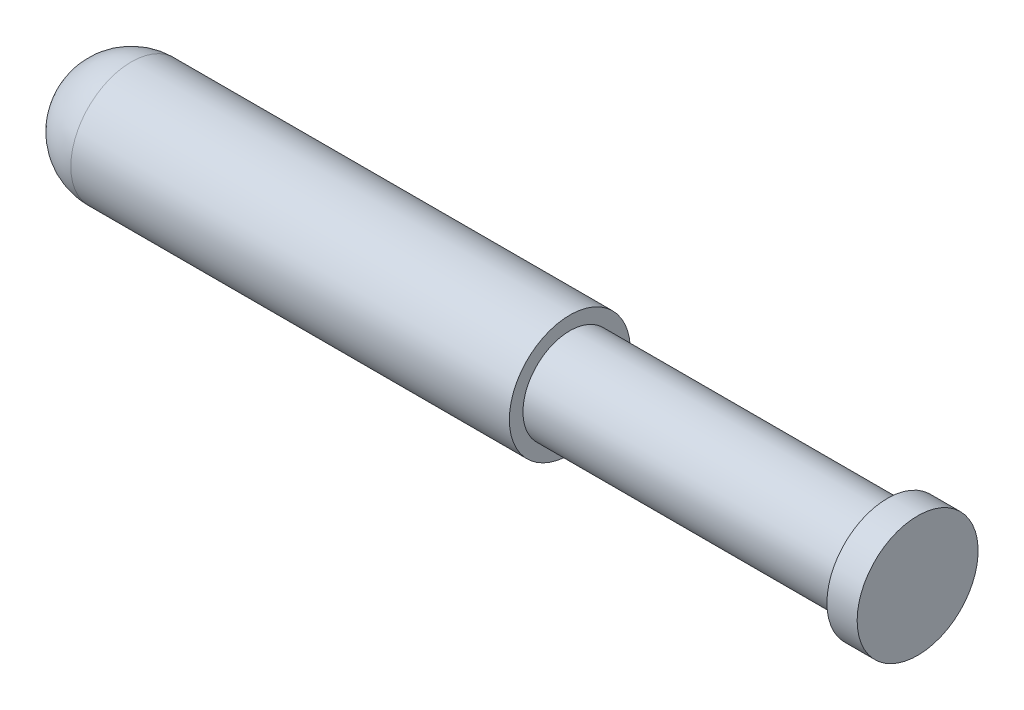
ISO-10303-21;
HEADER;
FILE_DESCRIPTION(('STEP AP214'),'2;1');
FILE_NAME('part.step','',(''),(''),'','','');
FILE_SCHEMA(('AUTOMOTIVE_DESIGN { 1 0 10303 214 1 1 1 1 }'));
ENDSEC;
DATA;
#1=APPLICATION_CONTEXT('core data for automotive mechanical design processes');
#2=APPLICATION_PROTOCOL_DEFINITION('international standard','automotive_design',2000,#1);
#3=PRODUCT_CONTEXT('',#1,'mechanical');
#4=PRODUCT('Part','Part','',(#3));
#5=PRODUCT_RELATED_PRODUCT_CATEGORY('part','',(#4));
#6=PRODUCT_DEFINITION_FORMATION('','',#4);
#7=PRODUCT_DEFINITION_CONTEXT('part definition',#1,'design');
#8=PRODUCT_DEFINITION('design','',#6,#7);
#9=PRODUCT_DEFINITION_SHAPE('','',#8);
#10=(LENGTH_UNIT() NAMED_UNIT(*) SI_UNIT(.MILLI.,.METRE.));
#11=(NAMED_UNIT(*) PLANE_ANGLE_UNIT() SI_UNIT($,.RADIAN.));
#12=(NAMED_UNIT(*) SI_UNIT($,.STERADIAN.) SOLID_ANGLE_UNIT());
#13=UNCERTAINTY_MEASURE_WITH_UNIT(LENGTH_MEASURE(1.E-05),#10,'distance_accuracy_value','');
#14=(GEOMETRIC_REPRESENTATION_CONTEXT(3) GLOBAL_UNCERTAINTY_ASSIGNED_CONTEXT((#13)) GLOBAL_UNIT_ASSIGNED_CONTEXT((#10,
#11,#12)) REPRESENTATION_CONTEXT('',''));
#15=CARTESIAN_POINT('',(0.,0.,0.));
#16=DIRECTION('',(0.,0.,1.));
#17=DIRECTION('',(1.,0.,0.));
#18=AXIS2_PLACEMENT_3D('',#15,#16,#17);
#19=CARTESIAN_POINT('',(0.,0.,0.));
#20=DIRECTION('',(-1.,0.,0.));
#21=DIRECTION('',(0.,0.,1.));
#22=AXIS2_PLACEMENT_3D('',#19,#20,#21);
#23=CYLINDRICAL_SURFACE('',#22,3.99999999999999);
#24=CARTESIAN_POINT('',(4.,0.,0.));
#25=DIRECTION('',(-1.,0.,0.));
#26=DIRECTION('',(0.,0.,1.));
#27=AXIS2_PLACEMENT_3D('',#24,#25,#26);
#28=CIRCLE('',#27,3.99999999999999);
#29=CARTESIAN_POINT('',(4.,0.,3.99999999999999));
#30=VERTEX_POINT('',#29);
#31=EDGE_CURVE('E10',#30,#30,#28,.F.);
#32=ORIENTED_EDGE('',*,*,#31,.T.);
#33=EDGE_LOOP('',(#32));
#34=FACE_BOUND('',#33,.T.);
#35=CARTESIAN_POINT('',(33.,0.,0.));
#36=DIRECTION('',(-1.,0.,0.));
#37=DIRECTION('',(0.,0.,1.));
#38=AXIS2_PLACEMENT_3D('',#35,#36,#37);
#39=CIRCLE('',#38,3.99999999999999);
#40=CARTESIAN_POINT('',(33.,0.,3.99999999999999));
#41=VERTEX_POINT('',#40);
#42=EDGE_CURVE('E38',#41,#41,#39,.T.);
#43=ORIENTED_EDGE('',*,*,#42,.T.);
#44=EDGE_LOOP('',(#43));
#45=FACE_BOUND('',#44,.T.);
#46=ADVANCED_FACE('F31',(#34,#45),#23,.T.);
#47=CARTESIAN_POINT('',(33.,3.99999999999999,0.));
#48=DIRECTION('',(-1.,0.,0.));
#49=DIRECTION('',(0.,0.,1.));
#50=AXIS2_PLACEMENT_3D('',#47,#48,#49);
#51=PLANE('',#50);
#52=ORIENTED_EDGE('',*,*,#42,.F.);
#53=EDGE_LOOP('',(#52));
#54=FACE_BOUND('',#53,.T.);
#55=CARTESIAN_POINT('',(33.,0.,0.));
#56=DIRECTION('',(-1.,0.,0.));
#57=DIRECTION('',(0.,0.,1.));
#58=AXIS2_PLACEMENT_3D('',#55,#56,#57);
#59=CIRCLE('',#58,3.1);
#60=CARTESIAN_POINT('',(33.,0.,3.1));
#61=VERTEX_POINT('',#60);
#62=EDGE_CURVE('E42',#61,#61,#59,.T.);
#63=ORIENTED_EDGE('',*,*,#62,.T.);
#64=EDGE_LOOP('',(#63));
#65=FACE_BOUND('',#64,.T.);
#66=ADVANCED_FACE('F72',(#54,#65),#51,.F.);
#67=CARTESIAN_POINT('',(0.,0.,0.));
#68=DIRECTION('',(-1.,0.,0.));
#69=DIRECTION('',(0.,0.,1.));
#70=AXIS2_PLACEMENT_3D('',#67,#68,#69);
#71=CYLINDRICAL_SURFACE('',#70,3.1);
#72=ORIENTED_EDGE('',*,*,#62,.F.);
#73=EDGE_LOOP('',(#72));
#74=FACE_BOUND('',#73,.T.);
#75=CARTESIAN_POINT('',(54.,0.,0.));
#76=DIRECTION('',(-1.,0.,0.));
#77=DIRECTION('',(0.,0.,1.));
#78=AXIS2_PLACEMENT_3D('',#75,#76,#77);
#79=CIRCLE('',#78,3.1);
#80=CARTESIAN_POINT('',(54.,0.,3.1));
#81=VERTEX_POINT('',#80);
#82=EDGE_CURVE('E46',#81,#81,#79,.T.);
#83=ORIENTED_EDGE('',*,*,#82,.T.);
#84=EDGE_LOOP('',(#83));
#85=FACE_BOUND('',#84,.T.);
#86=ADVANCED_FACE('F76',(#74,#85),#71,.T.);
#87=CARTESIAN_POINT('',(54.,3.1,0.));
#88=DIRECTION('',(1.,0.,0.));
#89=DIRECTION('',(0.,0.,-1.));
#90=AXIS2_PLACEMENT_3D('',#87,#88,#89);
#91=PLANE('',#90);
#92=ORIENTED_EDGE('',*,*,#82,.F.);
#93=EDGE_LOOP('',(#92));
#94=FACE_BOUND('',#93,.T.);
#95=CARTESIAN_POINT('',(54.,0.,0.));
#96=DIRECTION('',(-1.,0.,0.));
#97=DIRECTION('',(0.,0.,1.));
#98=AXIS2_PLACEMENT_3D('',#95,#96,#97);
#99=CIRCLE('',#98,4.);
#100=CARTESIAN_POINT('',(54.,0.,4.));
#101=VERTEX_POINT('',#100);
#102=EDGE_CURVE('E51',#101,#101,#99,.T.);
#103=ORIENTED_EDGE('',*,*,#102,.T.);
#104=EDGE_LOOP('',(#103));
#105=FACE_BOUND('',#104,.T.);
#106=ADVANCED_FACE('F68',(#94,#105),#91,.F.);
#107=CARTESIAN_POINT('',(0.,0.,0.));
#108=DIRECTION('',(-1.,0.,0.));
#109=DIRECTION('',(0.,0.,1.));
#110=AXIS2_PLACEMENT_3D('',#107,#108,#109);
#111=CYLINDRICAL_SURFACE('',#110,4.);
#112=ORIENTED_EDGE('',*,*,#102,.F.);
#113=EDGE_LOOP('',(#112));
#114=FACE_BOUND('',#113,.T.);
#115=CARTESIAN_POINT('',(56.,0.,0.));
#116=DIRECTION('',(-1.,0.,0.));
#117=DIRECTION('',(0.,0.,1.));
#118=AXIS2_PLACEMENT_3D('',#115,#116,#117);
#119=CIRCLE('',#118,4.);
#120=CARTESIAN_POINT('',(56.,0.,4.));
#121=VERTEX_POINT('',#120);
#122=EDGE_CURVE('E54',#121,#121,#119,.T.);
#123=ORIENTED_EDGE('',*,*,#122,.T.);
#124=EDGE_LOOP('',(#123));
#125=FACE_BOUND('',#124,.T.);
#126=ADVANCED_FACE('F58',(#114,#125),#111,.T.);
#127=CARTESIAN_POINT('',(56.,4.,0.));
#128=DIRECTION('',(-1.,0.,0.));
#129=DIRECTION('',(0.,0.,1.));
#130=AXIS2_PLACEMENT_3D('',#127,#128,#129);
#131=PLANE('',#130);
#132=ORIENTED_EDGE('',*,*,#122,.F.);
#133=EDGE_LOOP('',(#132));
#134=FACE_BOUND('',#133,.T.);
#135=ADVANCED_FACE('F60',(#134),#131,.F.);
#136=CARTESIAN_POINT('',(4.,0.,0.));
#137=DIRECTION('',(1.,0.,0.));
#138=DIRECTION('',(0.,0.,-1.));
#139=AXIS2_PLACEMENT_3D('',#136,#137,#138);
#140=SPHERICAL_SURFACE('',#139,4.);
#141=ORIENTED_EDGE('',*,*,#31,.F.);
#142=EDGE_LOOP('',(#141));
#143=FACE_BOUND('',#142,.T.);
#144=ADVANCED_FACE('F33',(#143),#140,.T.);
#145=CLOSED_SHELL('',(#46,#66,#86,#106,#126,#135,#144));
#146=MANIFOLD_SOLID_BREP('B2',#145);
#147=ADVANCED_BREP_SHAPE_REPRESENTATION('',(#18,#146),#14);
#148=SHAPE_DEFINITION_REPRESENTATION(#9,#147);
ENDSEC;
END-ISO-10303-21;
